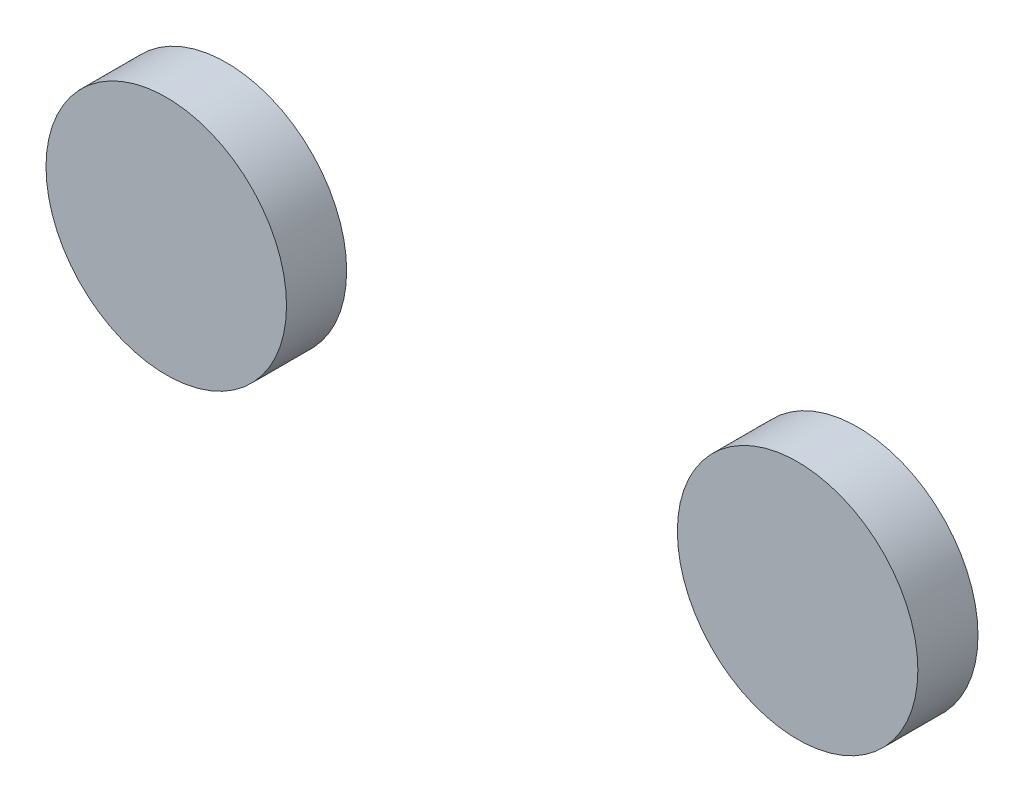
ISO-10303-21;
HEADER;
FILE_DESCRIPTION(('STEP AP214'),'2;1');
FILE_NAME('part.step','',(''),(''),'','','');
FILE_SCHEMA(('AUTOMOTIVE_DESIGN { 1 0 10303 214 1 1 1 1 }'));
ENDSEC;
DATA;
#1=APPLICATION_CONTEXT('core data for automotive mechanical design processes');
#2=APPLICATION_PROTOCOL_DEFINITION('international standard','automotive_design',2000,#1);
#3=PRODUCT_CONTEXT('',#1,'mechanical');
#4=PRODUCT('Part','Part','',(#3));
#5=PRODUCT_RELATED_PRODUCT_CATEGORY('part','',(#4));
#6=PRODUCT_DEFINITION_FORMATION('','',#4);
#7=PRODUCT_DEFINITION_CONTEXT('part definition',#1,'design');
#8=PRODUCT_DEFINITION('design','',#6,#7);
#9=PRODUCT_DEFINITION_SHAPE('','',#8);
#10=(LENGTH_UNIT() NAMED_UNIT(*) SI_UNIT(.MILLI.,.METRE.));
#11=(NAMED_UNIT(*) PLANE_ANGLE_UNIT() SI_UNIT($,.RADIAN.));
#12=(NAMED_UNIT(*) SI_UNIT($,.STERADIAN.) SOLID_ANGLE_UNIT());
#13=UNCERTAINTY_MEASURE_WITH_UNIT(LENGTH_MEASURE(1.E-05),#10,'distance_accuracy_value','');
#14=(GEOMETRIC_REPRESENTATION_CONTEXT(3) GLOBAL_UNCERTAINTY_ASSIGNED_CONTEXT((#13)) GLOBAL_UNIT_ASSIGNED_CONTEXT((#10,
#11,#12)) REPRESENTATION_CONTEXT('',''));
#15=CARTESIAN_POINT('',(0.,0.,0.));
#16=DIRECTION('',(0.,0.,1.));
#17=DIRECTION('',(1.,0.,0.));
#18=AXIS2_PLACEMENT_3D('',#15,#16,#17);
#19=CARTESIAN_POINT('',(53.6309889488754,-5.03090536683552,10.));
#20=DIRECTION('',(0.,0.,-1.));
#21=DIRECTION('',(-1.,0.,0.));
#22=AXIS2_PLACEMENT_3D('',#19,#20,#21);
#23=CYLINDRICAL_SURFACE('',#22,20.);
#24=CARTESIAN_POINT('',(53.6309889488754,-5.03090536683552,10.));
#25=DIRECTION('',(0.,0.,1.));
#26=DIRECTION('',(1.,0.,0.));
#27=AXIS2_PLACEMENT_3D('',#24,#25,#26);
#28=CIRCLE('',#27,20.);
#29=CARTESIAN_POINT('',(73.6309889488754,-5.03090536683552,10.));
#30=VERTEX_POINT('',#29);
#31=EDGE_CURVE('E11',#30,#30,#28,.T.);
#32=ORIENTED_EDGE('',*,*,#31,.F.);
#33=EDGE_LOOP('',(#32));
#34=FACE_BOUND('',#33,.T.);
#35=CARTESIAN_POINT('',(53.6309889488754,-5.03090536683552,0.));
#36=DIRECTION('',(0.,0.,1.));
#37=DIRECTION('',(1.,0.,0.));
#38=AXIS2_PLACEMENT_3D('',#35,#36,#37);
#39=CIRCLE('',#38,20.);
#40=CARTESIAN_POINT('',(73.6309889488754,-5.03090536683552,0.));
#41=VERTEX_POINT('',#40);
#42=EDGE_CURVE('E50',#41,#41,#39,.T.);
#43=ORIENTED_EDGE('',*,*,#42,.T.);
#44=EDGE_LOOP('',(#43));
#45=FACE_BOUND('',#44,.T.);
#46=ADVANCED_FACE('F47',(#34,#45),#23,.T.);
#47=CARTESIAN_POINT('',(0.,0.,10.));
#48=DIRECTION('',(0.,0.,1.));
#49=DIRECTION('',(1.,0.,0.));
#50=AXIS2_PLACEMENT_3D('',#47,#48,#49);
#51=PLANE('',#50);
#52=ORIENTED_EDGE('',*,*,#31,.T.);
#53=EDGE_LOOP('',(#52));
#54=FACE_BOUND('',#53,.T.);
#55=ADVANCED_FACE('F64',(#54),#51,.T.);
#56=CARTESIAN_POINT('',(0.,0.,0.));
#57=DIRECTION('',(0.,0.,1.));
#58=DIRECTION('',(1.,0.,0.));
#59=AXIS2_PLACEMENT_3D('',#56,#57,#58);
#60=PLANE('',#59);
#61=ORIENTED_EDGE('',*,*,#42,.F.);
#62=EDGE_LOOP('',(#61));
#63=FACE_BOUND('',#62,.T.);
#64=ADVANCED_FACE('F62',(#63),#60,.F.);
#65=CLOSED_SHELL('',(#46,#55,#64));
#66=MANIFOLD_SOLID_BREP('B2',#65);
#67=CARTESIAN_POINT('',(-51.3690110511246,-5.03090536683552,10.));
#68=DIRECTION('',(0.,0.,-1.));
#69=DIRECTION('',(-1.,0.,0.));
#70=AXIS2_PLACEMENT_3D('',#67,#68,#69);
#71=CYLINDRICAL_SURFACE('',#70,20.);
#72=CARTESIAN_POINT('',(-51.3690110511246,-5.03090536683552,10.));
#73=DIRECTION('',(0.,0.,1.));
#74=DIRECTION('',(1.,0.,0.));
#75=AXIS2_PLACEMENT_3D('',#72,#73,#74);
#76=CIRCLE('',#75,20.);
#77=CARTESIAN_POINT('',(-31.3690110511246,-5.03090536683552,10.));
#78=VERTEX_POINT('',#77);
#79=EDGE_CURVE('E46',#78,#78,#76,.T.);
#80=ORIENTED_EDGE('',*,*,#79,.F.);
#81=EDGE_LOOP('',(#80));
#82=FACE_BOUND('',#81,.T.);
#83=CARTESIAN_POINT('',(-51.3690110511246,-5.03090536683552,0.));
#84=DIRECTION('',(0.,0.,1.));
#85=DIRECTION('',(1.,0.,0.));
#86=AXIS2_PLACEMENT_3D('',#83,#84,#85);
#87=CIRCLE('',#86,20.);
#88=CARTESIAN_POINT('',(-31.3690110511246,-5.03090536683552,0.));
#89=VERTEX_POINT('',#88);
#90=EDGE_CURVE('E99',#89,#89,#87,.T.);
#91=ORIENTED_EDGE('',*,*,#90,.T.);
#92=EDGE_LOOP('',(#91));
#93=FACE_BOUND('',#92,.T.);
#94=ADVANCED_FACE('F96',(#82,#93),#71,.T.);
#95=CARTESIAN_POINT('',(0.,0.,10.));
#96=DIRECTION('',(0.,0.,1.));
#97=DIRECTION('',(1.,0.,0.));
#98=AXIS2_PLACEMENT_3D('',#95,#96,#97);
#99=PLANE('',#98);
#100=ORIENTED_EDGE('',*,*,#79,.T.);
#101=EDGE_LOOP('',(#100));
#102=FACE_BOUND('',#101,.T.);
#103=ADVANCED_FACE('F111',(#102),#99,.T.);
#104=CARTESIAN_POINT('',(0.,0.,0.));
#105=DIRECTION('',(0.,0.,1.));
#106=DIRECTION('',(1.,0.,0.));
#107=AXIS2_PLACEMENT_3D('',#104,#105,#106);
#108=PLANE('',#107);
#109=ORIENTED_EDGE('',*,*,#90,.F.);
#110=EDGE_LOOP('',(#109));
#111=FACE_BOUND('',#110,.T.);
#112=ADVANCED_FACE('F109',(#111),#108,.F.);
#113=CLOSED_SHELL('',(#94,#103,#112));
#114=MANIFOLD_SOLID_BREP('B6',#113);
#115=ADVANCED_BREP_SHAPE_REPRESENTATION('',(#18,#66,#114),#14);
#116=SHAPE_DEFINITION_REPRESENTATION(#9,#115);
ENDSEC;
END-ISO-10303-21;
